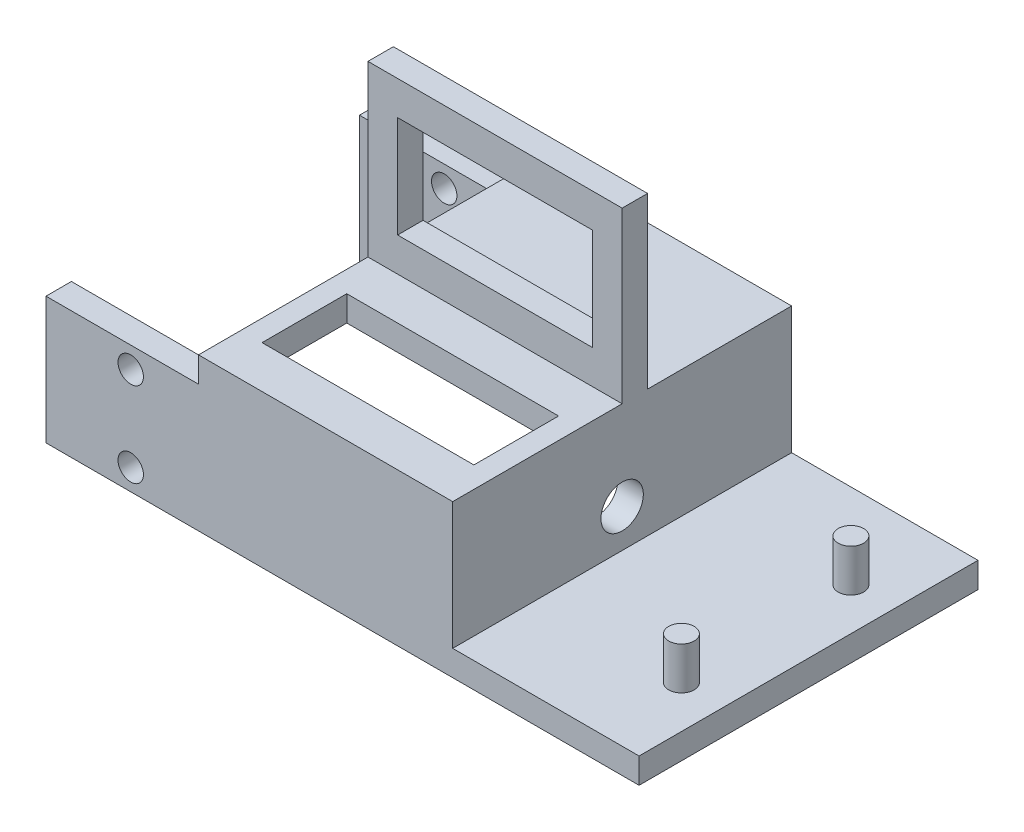
ISO-10303-21;
HEADER;
FILE_DESCRIPTION(('STEP AP214'),'2;1');
FILE_NAME('part.step','',(''),(''),'','','');
FILE_SCHEMA(('AUTOMOTIVE_DESIGN { 1 0 10303 214 1 1 1 1 }'));
ENDSEC;
DATA;
#1=APPLICATION_CONTEXT('core data for automotive mechanical design processes');
#2=APPLICATION_PROTOCOL_DEFINITION('international standard','automotive_design',2000,#1);
#3=PRODUCT_CONTEXT('',#1,'mechanical');
#4=PRODUCT('Part','Part','',(#3));
#5=PRODUCT_RELATED_PRODUCT_CATEGORY('part','',(#4));
#6=PRODUCT_DEFINITION_FORMATION('','',#4);
#7=PRODUCT_DEFINITION_CONTEXT('part definition',#1,'design');
#8=PRODUCT_DEFINITION('design','',#6,#7);
#9=PRODUCT_DEFINITION_SHAPE('','',#8);
#10=(LENGTH_UNIT() NAMED_UNIT(*) SI_UNIT(.MILLI.,.METRE.));
#11=(NAMED_UNIT(*) PLANE_ANGLE_UNIT() SI_UNIT($,.RADIAN.));
#12=(NAMED_UNIT(*) SI_UNIT($,.STERADIAN.) SOLID_ANGLE_UNIT());
#13=UNCERTAINTY_MEASURE_WITH_UNIT(LENGTH_MEASURE(1.E-05),#10,'distance_accuracy_value','');
#14=(GEOMETRIC_REPRESENTATION_CONTEXT(3) GLOBAL_UNCERTAINTY_ASSIGNED_CONTEXT((#13)) GLOBAL_UNIT_ASSIGNED_CONTEXT((#10,
#11,#12)) REPRESENTATION_CONTEXT('',''));
#15=CARTESIAN_POINT('',(0.,0.,0.));
#16=DIRECTION('',(0.,0.,1.));
#17=DIRECTION('',(1.,0.,0.));
#18=AXIS2_PLACEMENT_3D('',#15,#16,#17);
#19=CARTESIAN_POINT('',(0.,18.,0.));
#20=DIRECTION('',(0.,1.,0.));
#21=DIRECTION('',(0.,0.,1.));
#22=AXIS2_PLACEMENT_3D('',#19,#20,#21);
#23=PLANE('',#22);
#24=DIRECTION('',(0.,0.,1.));
#25=VECTOR('',#24,1.);
#26=CARTESIAN_POINT('',(-27.,18.,40.));
#27=LINE('',#26,#25);
#28=CARTESIAN_POINT('',(-27.,18.,0.));
#29=VERTEX_POINT('',#28);
#30=CARTESIAN_POINT('',(-27.,18.,17.));
#31=VERTEX_POINT('',#30);
#32=EDGE_CURVE('E66',#29,#31,#27,.T.);
#33=ORIENTED_EDGE('',*,*,#32,.T.);
#34=DIRECTION('',(1.,0.,0.));
#35=VECTOR('',#34,1.);
#36=CARTESIAN_POINT('',(-27.,18.,17.));
#37=LINE('',#36,#35);
#38=CARTESIAN_POINT('',(3.,18.,17.));
#39=VERTEX_POINT('',#38);
#40=EDGE_CURVE('E241',#31,#39,#37,.T.);
#41=ORIENTED_EDGE('',*,*,#40,.T.);
#42=DIRECTION('',(0.,0.,-1.));
#43=VECTOR('',#42,1.);
#44=CARTESIAN_POINT('',(3.,18.,40.));
#45=LINE('',#44,#43);
#46=CARTESIAN_POINT('',(3.,18.,0.));
#47=VERTEX_POINT('',#46);
#48=EDGE_CURVE('E353',#39,#47,#45,.T.);
#49=ORIENTED_EDGE('',*,*,#48,.T.);
#50=DIRECTION('',(-1.,0.,0.));
#51=VECTOR('',#50,1.);
#52=CARTESIAN_POINT('',(3.,18.,0.));
#53=LINE('',#52,#51);
#54=EDGE_CURVE('E350',#47,#29,#53,.T.);
#55=ORIENTED_EDGE('',*,*,#54,.T.);
#56=EDGE_LOOP('',(#33,#41,#49,#55));
#57=FACE_BOUND('',#56,.T.);
#58=ADVANCED_FACE('F38',(#57),#23,.T.);
#59=CARTESIAN_POINT('',(3.,15.,40.));
#60=DIRECTION('',(0.,-1.,0.));
#61=DIRECTION('',(0.,0.,-1.));
#62=AXIS2_PLACEMENT_3D('',#59,#60,#61);
#63=PLANE('',#62);
#64=DIRECTION('',(0.,0.,1.));
#65=VECTOR('',#64,1.);
#66=CARTESIAN_POINT('',(-27.,15.,40.));
#67=LINE('',#66,#65);
#68=CARTESIAN_POINT('',(-27.,15.,0.));
#69=VERTEX_POINT('',#68);
#70=CARTESIAN_POINT('',(-27.,15.,3.));
#71=VERTEX_POINT('',#70);
#72=EDGE_CURVE('E50',#69,#71,#67,.T.);
#73=ORIENTED_EDGE('',*,*,#72,.F.);
#74=DIRECTION('',(-1.,0.,0.));
#75=VECTOR('',#74,1.);
#76=CARTESIAN_POINT('',(3.,15.,0.));
#77=LINE('',#76,#75);
#78=CARTESIAN_POINT('',(-45.,15.,0.));
#79=VERTEX_POINT('',#78);
#80=EDGE_CURVE('E398',#69,#79,#77,.T.);
#81=ORIENTED_EDGE('',*,*,#80,.T.);
#82=DIRECTION('',(0.,0.,-1.));
#83=VECTOR('',#82,1.);
#84=CARTESIAN_POINT('',(-45.,15.,3.));
#85=LINE('',#84,#83);
#86=CARTESIAN_POINT('',(-45.,15.,3.));
#87=VERTEX_POINT('',#86);
#88=EDGE_CURVE('E371',#87,#79,#85,.T.);
#89=ORIENTED_EDGE('',*,*,#88,.F.);
#90=DIRECTION('',(1.,0.,0.));
#91=VECTOR('',#90,1.);
#92=CARTESIAN_POINT('',(0.,15.,3.));
#93=LINE('',#92,#91);
#94=EDGE_CURVE('E428',#87,#71,#93,.T.);
#95=ORIENTED_EDGE('',*,*,#94,.T.);
#96=EDGE_LOOP('',(#73,#81,#89,#95));
#97=FACE_BOUND('',#96,.T.);
#98=ADVANCED_FACE('F525',(#97),#63,.F.);
#99=CARTESIAN_POINT('',(-27.,15.,37.));
#100=VERTEX_POINT('',#99);
#101=CARTESIAN_POINT('',(-27.,15.,40.));
#102=VERTEX_POINT('',#101);
#103=EDGE_CURVE('E12',#100,#102,#67,.T.);
#104=ORIENTED_EDGE('',*,*,#103,.F.);
#105=DIRECTION('',(-1.,0.,0.));
#106=VECTOR('',#105,1.);
#107=CARTESIAN_POINT('',(0.,15.,37.));
#108=LINE('',#107,#106);
#109=CARTESIAN_POINT('',(-45.,15.,37.));
#110=VERTEX_POINT('',#109);
#111=EDGE_CURVE('E465',#100,#110,#108,.T.);
#112=ORIENTED_EDGE('',*,*,#111,.T.);
#113=DIRECTION('',(0.,0.,1.));
#114=VECTOR('',#113,1.);
#115=CARTESIAN_POINT('',(-45.,15.,37.));
#116=LINE('',#115,#114);
#117=CARTESIAN_POINT('',(-45.,15.,40.));
#118=VERTEX_POINT('',#117);
#119=EDGE_CURVE('E447',#110,#118,#116,.T.);
#120=ORIENTED_EDGE('',*,*,#119,.T.);
#121=DIRECTION('',(-1.,0.,0.));
#122=VECTOR('',#121,1.);
#123=CARTESIAN_POINT('',(3.,15.,40.));
#124=LINE('',#123,#122);
#125=EDGE_CURVE('E410',#102,#118,#124,.T.);
#126=ORIENTED_EDGE('',*,*,#125,.F.);
#127=EDGE_LOOP('',(#104,#112,#120,#126));
#128=FACE_BOUND('',#127,.T.);
#129=ADVANCED_FACE('F585',(#128),#63,.F.);
#130=CARTESIAN_POINT('',(25.,0.,40.));
#131=DIRECTION('',(-1.,0.,0.));
#132=DIRECTION('',(0.,0.,1.));
#133=AXIS2_PLACEMENT_3D('',#130,#131,#132);
#134=PLANE('',#133);
#135=DIRECTION('',(0.,1.,0.));
#136=VECTOR('',#135,1.);
#137=CARTESIAN_POINT('',(25.,0.,0.));
#138=LINE('',#137,#136);
#139=CARTESIAN_POINT('',(25.,0.,0.));
#140=VERTEX_POINT('',#139);
#141=CARTESIAN_POINT('',(25.,3.,0.));
#142=VERTEX_POINT('',#141);
#143=EDGE_CURVE('E405',#140,#142,#138,.T.);
#144=ORIENTED_EDGE('',*,*,#143,.T.);
#145=DIRECTION('',(0.,0.,-1.));
#146=VECTOR('',#145,1.);
#147=CARTESIAN_POINT('',(25.,3.,40.));
#148=LINE('',#147,#146);
#149=CARTESIAN_POINT('',(25.,3.,40.));
#150=VERTEX_POINT('',#149);
#151=EDGE_CURVE('E378',#150,#142,#148,.T.);
#152=ORIENTED_EDGE('',*,*,#151,.F.);
#153=DIRECTION('',(0.,1.,0.));
#154=VECTOR('',#153,1.);
#155=CARTESIAN_POINT('',(25.,0.,40.));
#156=LINE('',#155,#154);
#157=CARTESIAN_POINT('',(25.,0.,40.));
#158=VERTEX_POINT('',#157);
#159=EDGE_CURVE('E397',#158,#150,#156,.T.);
#160=ORIENTED_EDGE('',*,*,#159,.F.);
#161=DIRECTION('',(0.,0.,-1.));
#162=VECTOR('',#161,1.);
#163=CARTESIAN_POINT('',(25.,0.,40.));
#164=LINE('',#163,#162);
#165=EDGE_CURVE('E391',#158,#140,#164,.T.);
#166=ORIENTED_EDGE('',*,*,#165,.T.);
#167=EDGE_LOOP('',(#144,#152,#160,#166));
#168=FACE_BOUND('',#167,.T.);
#169=ADVANCED_FACE('F40',(#168),#134,.F.);
#170=CARTESIAN_POINT('',(25.,3.,40.));
#171=DIRECTION('',(0.,-1.,0.));
#172=DIRECTION('',(1.,0.,0.));
#173=AXIS2_PLACEMENT_3D('',#170,#171,#172);
#174=PLANE('',#173);
#175=CARTESIAN_POINT('',(20.,3.,30.));
#176=DIRECTION('',(0.,-1.,0.));
#177=DIRECTION('',(1.,0.,0.));
#178=AXIS2_PLACEMENT_3D('',#175,#176,#177);
#179=CIRCLE('',#178,1.5);
#180=CARTESIAN_POINT('',(21.5,3.,30.));
#181=VERTEX_POINT('',#180);
#182=EDGE_CURVE('E372',#181,#181,#179,.F.);
#183=ORIENTED_EDGE('',*,*,#182,.F.);
#184=EDGE_LOOP('',(#183));
#185=FACE_BOUND('',#184,.T.);
#186=CARTESIAN_POINT('',(20.,3.,10.));
#187=DIRECTION('',(0.,-1.,0.));
#188=DIRECTION('',(1.,0.,0.));
#189=AXIS2_PLACEMENT_3D('',#186,#187,#188);
#190=CIRCLE('',#189,1.5);
#191=CARTESIAN_POINT('',(21.5,3.,10.));
#192=VERTEX_POINT('',#191);
#193=EDGE_CURVE('E375',#192,#192,#190,.F.);
#194=ORIENTED_EDGE('',*,*,#193,.F.);
#195=EDGE_LOOP('',(#194));
#196=FACE_BOUND('',#195,.T.);
#197=DIRECTION('',(-1.,0.,0.));
#198=VECTOR('',#197,1.);
#199=CARTESIAN_POINT('',(25.,3.,0.));
#200=LINE('',#199,#198);
#201=CARTESIAN_POINT('',(3.,3.,0.));
#202=VERTEX_POINT('',#201);
#203=EDGE_CURVE('E403',#142,#202,#200,.T.);
#204=ORIENTED_EDGE('',*,*,#203,.T.);
#205=DIRECTION('',(0.,0.,-1.));
#206=VECTOR('',#205,1.);
#207=CARTESIAN_POINT('',(3.,3.,40.));
#208=LINE('',#207,#206);
#209=CARTESIAN_POINT('',(3.,3.,40.));
#210=VERTEX_POINT('',#209);
#211=EDGE_CURVE('E381',#210,#202,#208,.T.);
#212=ORIENTED_EDGE('',*,*,#211,.F.);
#213=DIRECTION('',(-1.,0.,0.));
#214=VECTOR('',#213,1.);
#215=CARTESIAN_POINT('',(25.,3.,40.));
#216=LINE('',#215,#214);
#217=EDGE_CURVE('E414',#150,#210,#216,.T.);
#218=ORIENTED_EDGE('',*,*,#217,.F.);
#219=ORIENTED_EDGE('',*,*,#151,.T.);
#220=EDGE_LOOP('',(#204,#212,#218,#219));
#221=FACE_BOUND('',#220,.T.);
#222=ADVANCED_FACE('F513',(#185,#196,#221),#174,.F.);
#223=CARTESIAN_POINT('',(3.,3.,40.));
#224=DIRECTION('',(-1.,0.,0.));
#225=DIRECTION('',(0.,-1.,0.));
#226=AXIS2_PLACEMENT_3D('',#223,#224,#225);
#227=PLANE('',#226);
#228=CARTESIAN_POINT('',(3.,7.5,20.));
#229=DIRECTION('',(-1.,0.,0.));
#230=DIRECTION('',(0.,-1.,0.));
#231=AXIS2_PLACEMENT_3D('',#228,#229,#230);
#232=CIRCLE('',#231,2.5);
#233=CARTESIAN_POINT('',(3.,5.,20.));
#234=VERTEX_POINT('',#233);
#235=EDGE_CURVE('E370',#234,#234,#232,.T.);
#236=ORIENTED_EDGE('',*,*,#235,.T.);
#237=EDGE_LOOP('',(#236));
#238=FACE_BOUND('',#237,.T.);
#239=DIRECTION('',(0.,1.,0.));
#240=VECTOR('',#239,1.);
#241=CARTESIAN_POINT('',(3.,3.,0.));
#242=LINE('',#241,#240);
#243=EDGE_CURVE('E400',#202,#47,#242,.T.);
#244=ORIENTED_EDGE('',*,*,#243,.T.);
#245=ORIENTED_EDGE('',*,*,#48,.F.);
#246=DIRECTION('',(0.,1.,0.));
#247=VECTOR('',#246,1.);
#248=CARTESIAN_POINT('',(3.,18.,17.));
#249=LINE('',#248,#247);
#250=CARTESIAN_POINT('',(3.,38.,17.));
#251=VERTEX_POINT('',#250);
#252=EDGE_CURVE('E280',#39,#251,#249,.T.);
#253=ORIENTED_EDGE('',*,*,#252,.T.);
#254=DIRECTION('',(0.,0.,-1.));
#255=VECTOR('',#254,1.);
#256=CARTESIAN_POINT('',(3.,38.,20.));
#257=LINE('',#256,#255);
#258=CARTESIAN_POINT('',(3.,38.,20.));
#259=VERTEX_POINT('',#258);
#260=EDGE_CURVE('E302',#259,#251,#257,.T.);
#261=ORIENTED_EDGE('',*,*,#260,.F.);
#262=DIRECTION('',(0.,1.,0.));
#263=VECTOR('',#262,1.);
#264=CARTESIAN_POINT('',(3.,18.,20.));
#265=LINE('',#264,#263);
#266=CARTESIAN_POINT('',(3.,18.,20.));
#267=VERTEX_POINT('',#266);
#268=EDGE_CURVE('E307',#267,#259,#265,.T.);
#269=ORIENTED_EDGE('',*,*,#268,.F.);
#270=CARTESIAN_POINT('',(3.,18.,40.));
#271=VERTEX_POINT('',#270);
#272=EDGE_CURVE('E355',#271,#267,#45,.T.);
#273=ORIENTED_EDGE('',*,*,#272,.F.);
#274=DIRECTION('',(0.,1.,0.));
#275=VECTOR('',#274,1.);
#276=CARTESIAN_POINT('',(3.,3.,40.));
#277=LINE('',#276,#275);
#278=EDGE_CURVE('E412',#210,#271,#277,.T.);
#279=ORIENTED_EDGE('',*,*,#278,.F.);
#280=ORIENTED_EDGE('',*,*,#211,.T.);
#281=EDGE_LOOP('',(#244,#245,#253,#261,#269,#273,#279,#280));
#282=FACE_BOUND('',#281,.T.);
#283=ADVANCED_FACE('F507',(#238,#282),#227,.F.);
#284=DIRECTION('',(0.,0.,-1.));
#285=VECTOR('',#284,1.);
#286=CARTESIAN_POINT('',(0.500000000000004,15.,25.));
#287=LINE('',#286,#285);
#288=CARTESIAN_POINT('',(0.500000000000005,15.,35.));
#289=VERTEX_POINT('',#288);
#290=CARTESIAN_POINT('',(0.500000000000004,15.,25.));
#291=VERTEX_POINT('',#290);
#292=EDGE_CURVE('E275',#289,#291,#287,.T.);
#293=ORIENTED_EDGE('',*,*,#292,.T.);
#294=DIRECTION('',(-1.,0.,0.));
#295=VECTOR('',#294,1.);
#296=CARTESIAN_POINT('',(-24.5,15.,25.));
#297=LINE('',#296,#295);
#298=CARTESIAN_POINT('',(0.,15.,25.));
#299=VERTEX_POINT('',#298);
#300=EDGE_CURVE('E331',#291,#299,#297,.T.);
#301=ORIENTED_EDGE('',*,*,#300,.T.);
#302=DIRECTION('',(0.,0.,-1.));
#303=VECTOR('',#302,1.);
#304=CARTESIAN_POINT('',(0.,15.,40.));
#305=LINE('',#304,#303);
#306=CARTESIAN_POINT('',(0.,15.,35.));
#307=VERTEX_POINT('',#306);
#308=EDGE_CURVE('E387',#307,#299,#305,.T.);
#309=ORIENTED_EDGE('',*,*,#308,.F.);
#310=DIRECTION('',(1.,0.,0.));
#311=VECTOR('',#310,1.);
#312=CARTESIAN_POINT('',(-24.5,15.,35.));
#313=LINE('',#312,#311);
#314=EDGE_CURVE('E48',#307,#289,#313,.T.);
#315=ORIENTED_EDGE('',*,*,#314,.T.);
#316=EDGE_LOOP('',(#293,#301,#309,#315));
#317=FACE_BOUND('',#316,.T.);
#318=ADVANCED_FACE('F544',(#317),#63,.F.);
#319=CARTESIAN_POINT('',(0.,15.,40.));
#320=DIRECTION('',(1.,0.,0.));
#321=DIRECTION('',(0.,1.,0.));
#322=AXIS2_PLACEMENT_3D('',#319,#320,#321);
#323=PLANE('',#322);
#324=CARTESIAN_POINT('',(0.,7.5,20.));
#325=DIRECTION('',(1.,0.,0.));
#326=DIRECTION('',(0.,1.,0.));
#327=AXIS2_PLACEMENT_3D('',#324,#325,#326);
#328=CIRCLE('',#327,2.5);
#329=CARTESIAN_POINT('',(0.,10.,20.));
#330=VERTEX_POINT('',#329);
#331=EDGE_CURVE('E367',#330,#330,#328,.T.);
#332=ORIENTED_EDGE('',*,*,#331,.T.);
#333=EDGE_LOOP('',(#332));
#334=FACE_BOUND('',#333,.T.);
#335=DIRECTION('',(0.,0.,-1.));
#336=VECTOR('',#335,1.);
#337=CARTESIAN_POINT('',(0.,0.,40.));
#338=LINE('',#337,#336);
#339=CARTESIAN_POINT('',(0.,0.,37.));
#340=VERTEX_POINT('',#339);
#341=CARTESIAN_POINT('',(0.,0.,3.));
#342=VERTEX_POINT('',#341);
#343=EDGE_CURVE('E389',#340,#342,#338,.T.);
#344=ORIENTED_EDGE('',*,*,#343,.F.);
#345=DIRECTION('',(0.,1.,0.));
#346=VECTOR('',#345,1.);
#347=CARTESIAN_POINT('',(0.,15.,37.));
#348=LINE('',#347,#346);
#349=CARTESIAN_POINT('',(0.,15.,37.));
#350=VERTEX_POINT('',#349);
#351=EDGE_CURVE('E456',#340,#350,#348,.T.);
#352=ORIENTED_EDGE('',*,*,#351,.T.);
#353=EDGE_CURVE('E384',#350,#307,#305,.T.);
#354=ORIENTED_EDGE('',*,*,#353,.T.);
#355=ORIENTED_EDGE('',*,*,#308,.T.);
#356=CARTESIAN_POINT('',(0.,15.,3.));
#357=VERTEX_POINT('',#356);
#358=EDGE_CURVE('E388',#299,#357,#305,.T.);
#359=ORIENTED_EDGE('',*,*,#358,.T.);
#360=DIRECTION('',(0.,-1.,0.));
#361=VECTOR('',#360,1.);
#362=CARTESIAN_POINT('',(0.,15.,3.));
#363=LINE('',#362,#361);
#364=EDGE_CURVE('E434',#357,#342,#363,.T.);
#365=ORIENTED_EDGE('',*,*,#364,.T.);
#366=EDGE_LOOP('',(#344,#352,#354,#355,#359,#365));
#367=FACE_BOUND('',#366,.T.);
#368=ADVANCED_FACE('F540',(#334,#367),#323,.F.);
#369=CARTESIAN_POINT('',(0.,0.,40.));
#370=DIRECTION('',(0.,1.,0.));
#371=DIRECTION('',(0.,0.,1.));
#372=AXIS2_PLACEMENT_3D('',#369,#370,#371);
#373=PLANE('',#372);
#374=DIRECTION('',(1.,0.,0.));
#375=VECTOR('',#374,1.);
#376=CARTESIAN_POINT('',(0.,0.,0.));
#377=LINE('',#376,#375);
#378=CARTESIAN_POINT('',(-45.,0.,0.));
#379=VERTEX_POINT('',#378);
#380=EDGE_CURVE('E395',#379,#140,#377,.T.);
#381=ORIENTED_EDGE('',*,*,#380,.T.);
#382=ORIENTED_EDGE('',*,*,#165,.F.);
#383=DIRECTION('',(1.,0.,0.));
#384=VECTOR('',#383,1.);
#385=CARTESIAN_POINT('',(0.,0.,40.));
#386=LINE('',#385,#384);
#387=CARTESIAN_POINT('',(-45.,0.,40.));
#388=VERTEX_POINT('',#387);
#389=EDGE_CURVE('E394',#388,#158,#386,.T.);
#390=ORIENTED_EDGE('',*,*,#389,.F.);
#391=DIRECTION('',(0.,0.,1.));
#392=VECTOR('',#391,1.);
#393=CARTESIAN_POINT('',(-45.,0.,37.));
#394=LINE('',#393,#392);
#395=CARTESIAN_POINT('',(-45.,0.,37.));
#396=VERTEX_POINT('',#395);
#397=EDGE_CURVE('E435',#396,#388,#394,.T.);
#398=ORIENTED_EDGE('',*,*,#397,.F.);
#399=DIRECTION('',(1.,0.,0.));
#400=VECTOR('',#399,1.);
#401=CARTESIAN_POINT('',(0.,0.,37.));
#402=LINE('',#401,#400);
#403=EDGE_CURVE('E450',#396,#340,#402,.T.);
#404=ORIENTED_EDGE('',*,*,#403,.T.);
#405=ORIENTED_EDGE('',*,*,#343,.T.);
#406=DIRECTION('',(-1.,0.,0.));
#407=VECTOR('',#406,1.);
#408=CARTESIAN_POINT('',(0.,0.,3.));
#409=LINE('',#408,#407);
#410=CARTESIAN_POINT('',(-45.,0.,3.));
#411=VERTEX_POINT('',#410);
#412=EDGE_CURVE('E442',#342,#411,#409,.T.);
#413=ORIENTED_EDGE('',*,*,#412,.T.);
#414=DIRECTION('',(0.,0.,-1.));
#415=VECTOR('',#414,1.);
#416=CARTESIAN_POINT('',(-45.,0.,3.));
#417=LINE('',#416,#415);
#418=EDGE_CURVE('E425',#411,#379,#417,.T.);
#419=ORIENTED_EDGE('',*,*,#418,.T.);
#420=EDGE_LOOP('',(#381,#382,#390,#398,#404,#405,#413,#419));
#421=FACE_BOUND('',#420,.T.);
#422=ADVANCED_FACE('F518',(#421),#373,.F.);
#423=CARTESIAN_POINT('',(0.,0.,40.));
#424=DIRECTION('',(0.,0.,1.));
#425=DIRECTION('',(1.,0.,0.));
#426=AXIS2_PLACEMENT_3D('',#423,#424,#425);
#427=PLANE('',#426);
#428=CARTESIAN_POINT('',(-35.,12.5,40.));
#429=DIRECTION('',(0.,0.,1.));
#430=DIRECTION('',(1.,0.,0.));
#431=AXIS2_PLACEMENT_3D('',#428,#429,#430);
#432=CIRCLE('',#431,1.5);
#433=CARTESIAN_POINT('',(-33.5,12.5,40.));
#434=VERTEX_POINT('',#433);
#435=EDGE_CURVE('E457',#434,#434,#432,.T.);
#436=ORIENTED_EDGE('',*,*,#435,.F.);
#437=EDGE_LOOP('',(#436));
#438=FACE_BOUND('',#437,.T.);
#439=CARTESIAN_POINT('',(-35.,2.5,40.));
#440=DIRECTION('',(0.,0.,1.));
#441=DIRECTION('',(1.,0.,0.));
#442=AXIS2_PLACEMENT_3D('',#439,#440,#441);
#443=CIRCLE('',#442,1.5);
#444=CARTESIAN_POINT('',(-33.5,2.5,40.));
#445=VERTEX_POINT('',#444);
#446=EDGE_CURVE('E361',#445,#445,#443,.T.);
#447=ORIENTED_EDGE('',*,*,#446,.F.);
#448=EDGE_LOOP('',(#447));
#449=FACE_BOUND('',#448,.T.);
#450=ORIENTED_EDGE('',*,*,#159,.T.);
#451=ORIENTED_EDGE('',*,*,#217,.T.);
#452=ORIENTED_EDGE('',*,*,#278,.T.);
#453=DIRECTION('',(1.,0.,0.));
#454=VECTOR('',#453,1.);
#455=CARTESIAN_POINT('',(3.,18.,40.));
#456=LINE('',#455,#454);
#457=CARTESIAN_POINT('',(-27.,18.,40.));
#458=VERTEX_POINT('',#457);
#459=EDGE_CURVE('E485',#458,#271,#456,.T.);
#460=ORIENTED_EDGE('',*,*,#459,.F.);
#461=DIRECTION('',(0.,-1.,0.));
#462=VECTOR('',#461,1.);
#463=CARTESIAN_POINT('',(-27.,18.,40.));
#464=LINE('',#463,#462);
#465=EDGE_CURVE('E483',#458,#102,#464,.T.);
#466=ORIENTED_EDGE('',*,*,#465,.T.);
#467=ORIENTED_EDGE('',*,*,#125,.T.);
#468=DIRECTION('',(0.,-1.,0.));
#469=VECTOR('',#468,1.);
#470=CARTESIAN_POINT('',(-45.,15.,40.));
#471=LINE('',#470,#469);
#472=EDGE_CURVE('E453',#118,#388,#471,.T.);
#473=ORIENTED_EDGE('',*,*,#472,.T.);
#474=ORIENTED_EDGE('',*,*,#389,.T.);
#475=EDGE_LOOP('',(#450,#451,#452,#460,#466,#467,#473,#474));
#476=FACE_BOUND('',#475,.T.);
#477=ADVANCED_FACE('F643',(#438,#449,#476),#427,.T.);
#478=CARTESIAN_POINT('',(0.,0.,0.));
#479=DIRECTION('',(0.,0.,1.));
#480=DIRECTION('',(1.,0.,0.));
#481=AXIS2_PLACEMENT_3D('',#478,#479,#480);
#482=PLANE('',#481);
#483=CARTESIAN_POINT('',(-35.,12.5,0.));
#484=DIRECTION('',(0.,0.,1.));
#485=DIRECTION('',(1.,0.,0.));
#486=AXIS2_PLACEMENT_3D('',#483,#484,#485);
#487=CIRCLE('',#486,1.5);
#488=CARTESIAN_POINT('',(-33.5,12.5,0.));
#489=VERTEX_POINT('',#488);
#490=EDGE_CURVE('E366',#489,#489,#487,.T.);
#491=ORIENTED_EDGE('',*,*,#490,.T.);
#492=EDGE_LOOP('',(#491));
#493=FACE_BOUND('',#492,.T.);
#494=CARTESIAN_POINT('',(-35.,2.5,0.));
#495=DIRECTION('',(0.,0.,1.));
#496=DIRECTION('',(-1.,0.,0.));
#497=AXIS2_PLACEMENT_3D('',#494,#495,#496);
#498=CIRCLE('',#497,1.5);
#499=CARTESIAN_POINT('',(-36.5,2.5,0.));
#500=VERTEX_POINT('',#499);
#501=EDGE_CURVE('E476',#500,#500,#498,.T.);
#502=ORIENTED_EDGE('',*,*,#501,.T.);
#503=EDGE_LOOP('',(#502));
#504=FACE_BOUND('',#503,.T.);
#505=ORIENTED_EDGE('',*,*,#143,.F.);
#506=ORIENTED_EDGE('',*,*,#380,.F.);
#507=DIRECTION('',(0.,1.,0.));
#508=VECTOR('',#507,1.);
#509=CARTESIAN_POINT('',(-45.,15.,0.));
#510=LINE('',#509,#508);
#511=EDGE_CURVE('E431',#379,#79,#510,.T.);
#512=ORIENTED_EDGE('',*,*,#511,.T.);
#513=ORIENTED_EDGE('',*,*,#80,.F.);
#514=DIRECTION('',(0.,-1.,0.));
#515=VECTOR('',#514,1.);
#516=CARTESIAN_POINT('',(-27.,18.,0.));
#517=LINE('',#516,#515);
#518=EDGE_CURVE('E479',#29,#69,#517,.T.);
#519=ORIENTED_EDGE('',*,*,#518,.F.);
#520=ORIENTED_EDGE('',*,*,#54,.F.);
#521=ORIENTED_EDGE('',*,*,#243,.F.);
#522=ORIENTED_EDGE('',*,*,#203,.F.);
#523=EDGE_LOOP('',(#505,#506,#512,#513,#519,#520,#521,#522));
#524=FACE_BOUND('',#523,.T.);
#525=ADVANCED_FACE('F499',(#493,#504,#524),#482,.F.);
#526=CARTESIAN_POINT('',(20.,8.,10.));
#527=DIRECTION('',(0.,-1.,0.));
#528=DIRECTION('',(1.,0.,0.));
#529=AXIS2_PLACEMENT_3D('',#526,#527,#528);
#530=CYLINDRICAL_SURFACE('',#529,1.5);
#531=CARTESIAN_POINT('',(20.,8.,10.));
#532=DIRECTION('',(0.,1.,0.));
#533=DIRECTION('',(-1.,0.,0.));
#534=AXIS2_PLACEMENT_3D('',#531,#532,#533);
#535=CIRCLE('',#534,1.5);
#536=CARTESIAN_POINT('',(18.5,8.,10.));
#537=VERTEX_POINT('',#536);
#538=EDGE_CURVE('E408',#537,#537,#535,.T.);
#539=ORIENTED_EDGE('',*,*,#538,.F.);
#540=EDGE_LOOP('',(#539));
#541=FACE_BOUND('',#540,.T.);
#542=ORIENTED_EDGE('',*,*,#193,.T.);
#543=EDGE_LOOP('',(#542));
#544=FACE_BOUND('',#543,.T.);
#545=ADVANCED_FACE('F638',(#541,#544),#530,.T.);
#546=CARTESIAN_POINT('',(20.,8.,10.));
#547=DIRECTION('',(0.,1.,0.));
#548=DIRECTION('',(-1.,0.,0.));
#549=AXIS2_PLACEMENT_3D('',#546,#547,#548);
#550=PLANE('',#549);
#551=ORIENTED_EDGE('',*,*,#538,.T.);
#552=EDGE_LOOP('',(#551));
#553=FACE_BOUND('',#552,.T.);
#554=ADVANCED_FACE('F634',(#553),#550,.T.);
#555=CARTESIAN_POINT('',(20.,8.,30.));
#556=DIRECTION('',(0.,-1.,0.));
#557=DIRECTION('',(1.,0.,0.));
#558=AXIS2_PLACEMENT_3D('',#555,#556,#557);
#559=CYLINDRICAL_SURFACE('',#558,1.5);
#560=CARTESIAN_POINT('',(20.,8.,30.));
#561=DIRECTION('',(0.,1.,0.));
#562=DIRECTION('',(1.,0.,0.));
#563=AXIS2_PLACEMENT_3D('',#560,#561,#562);
#564=CIRCLE('',#563,1.5);
#565=CARTESIAN_POINT('',(21.5,8.,30.));
#566=VERTEX_POINT('',#565);
#567=EDGE_CURVE('E420',#566,#566,#564,.T.);
#568=ORIENTED_EDGE('',*,*,#567,.F.);
#569=EDGE_LOOP('',(#568));
#570=FACE_BOUND('',#569,.T.);
#571=ORIENTED_EDGE('',*,*,#182,.T.);
#572=EDGE_LOOP('',(#571));
#573=FACE_BOUND('',#572,.T.);
#574=ADVANCED_FACE('F630',(#570,#573),#559,.T.);
#575=CARTESIAN_POINT('',(20.,8.,30.));
#576=DIRECTION('',(0.,-1.,0.));
#577=DIRECTION('',(1.,0.,0.));
#578=AXIS2_PLACEMENT_3D('',#575,#576,#577);
#579=PLANE('',#578);
#580=ORIENTED_EDGE('',*,*,#567,.T.);
#581=EDGE_LOOP('',(#580));
#582=FACE_BOUND('',#581,.T.);
#583=ADVANCED_FACE('F626',(#582),#579,.F.);
#584=CARTESIAN_POINT('',(25.,7.5,20.));
#585=DIRECTION('',(-1.,0.,0.));
#586=DIRECTION('',(0.,-1.,0.));
#587=AXIS2_PLACEMENT_3D('',#584,#585,#586);
#588=CYLINDRICAL_SURFACE('',#587,2.5);
#589=ORIENTED_EDGE('',*,*,#331,.F.);
#590=EDGE_LOOP('',(#589));
#591=FACE_BOUND('',#590,.T.);
#592=ORIENTED_EDGE('',*,*,#235,.F.);
#593=EDGE_LOOP('',(#592));
#594=FACE_BOUND('',#593,.T.);
#595=ADVANCED_FACE('F623',(#591,#594),#588,.F.);
#596=CARTESIAN_POINT('',(-45.,15.,3.));
#597=DIRECTION('',(-1.,0.,0.));
#598=DIRECTION('',(0.,0.,1.));
#599=AXIS2_PLACEMENT_3D('',#596,#597,#598);
#600=PLANE('',#599);
#601=ORIENTED_EDGE('',*,*,#511,.F.);
#602=ORIENTED_EDGE('',*,*,#418,.F.);
#603=DIRECTION('',(0.,1.,0.));
#604=VECTOR('',#603,1.);
#605=CARTESIAN_POINT('',(-45.,15.,3.));
#606=LINE('',#605,#604);
#607=EDGE_CURVE('E439',#411,#87,#606,.T.);
#608=ORIENTED_EDGE('',*,*,#607,.T.);
#609=ORIENTED_EDGE('',*,*,#88,.T.);
#610=EDGE_LOOP('',(#601,#602,#608,#609));
#611=FACE_BOUND('',#610,.T.);
#612=ADVANCED_FACE('F521',(#611),#600,.T.);
#613=CARTESIAN_POINT('',(0.,0.,3.));
#614=DIRECTION('',(0.,0.,-1.));
#615=DIRECTION('',(-1.,0.,0.));
#616=AXIS2_PLACEMENT_3D('',#613,#614,#615);
#617=PLANE('',#616);
#618=CARTESIAN_POINT('',(-35.,12.5,3.));
#619=DIRECTION('',(0.,0.,-1.));
#620=DIRECTION('',(-1.,0.,0.));
#621=AXIS2_PLACEMENT_3D('',#618,#619,#620);
#622=CIRCLE('',#621,1.5);
#623=CARTESIAN_POINT('',(-36.5,12.5,3.));
#624=VERTEX_POINT('',#623);
#625=EDGE_CURVE('E360',#624,#624,#622,.T.);
#626=ORIENTED_EDGE('',*,*,#625,.T.);
#627=EDGE_LOOP('',(#626));
#628=FACE_BOUND('',#627,.T.);
#629=CARTESIAN_POINT('',(-35.,2.5,3.));
#630=DIRECTION('',(0.,0.,-1.));
#631=DIRECTION('',(-1.,0.,0.));
#632=AXIS2_PLACEMENT_3D('',#629,#630,#631);
#633=CIRCLE('',#632,1.5);
#634=CARTESIAN_POINT('',(-36.5,2.5,3.));
#635=VERTEX_POINT('',#634);
#636=EDGE_CURVE('E365',#635,#635,#633,.T.);
#637=ORIENTED_EDGE('',*,*,#636,.T.);
#638=EDGE_LOOP('',(#637));
#639=FACE_BOUND('',#638,.T.);
#640=ORIENTED_EDGE('',*,*,#364,.F.);
#641=EDGE_CURVE('E438',#71,#357,#93,.T.);
#642=ORIENTED_EDGE('',*,*,#641,.F.);
#643=ORIENTED_EDGE('',*,*,#94,.F.);
#644=ORIENTED_EDGE('',*,*,#607,.F.);
#645=ORIENTED_EDGE('',*,*,#412,.F.);
#646=EDGE_LOOP('',(#640,#642,#643,#644,#645));
#647=FACE_BOUND('',#646,.T.);
#648=ADVANCED_FACE('F531',(#628,#639,#647),#617,.F.);
#649=CARTESIAN_POINT('',(-45.,15.,37.));
#650=DIRECTION('',(-1.,0.,0.));
#651=DIRECTION('',(0.,0.,1.));
#652=AXIS2_PLACEMENT_3D('',#649,#650,#651);
#653=PLANE('',#652);
#654=ORIENTED_EDGE('',*,*,#472,.F.);
#655=ORIENTED_EDGE('',*,*,#119,.F.);
#656=DIRECTION('',(0.,-1.,0.));
#657=VECTOR('',#656,1.);
#658=CARTESIAN_POINT('',(-45.,15.,37.));
#659=LINE('',#658,#657);
#660=EDGE_CURVE('E460',#110,#396,#659,.T.);
#661=ORIENTED_EDGE('',*,*,#660,.T.);
#662=ORIENTED_EDGE('',*,*,#397,.T.);
#663=EDGE_LOOP('',(#654,#655,#661,#662));
#664=FACE_BOUND('',#663,.T.);
#665=ADVANCED_FACE('F613',(#664),#653,.T.);
#666=CARTESIAN_POINT('',(0.,0.,37.));
#667=DIRECTION('',(0.,0.,-1.));
#668=DIRECTION('',(-1.,0.,0.));
#669=AXIS2_PLACEMENT_3D('',#666,#667,#668);
#670=PLANE('',#669);
#671=CARTESIAN_POINT('',(-35.,12.5,37.));
#672=DIRECTION('',(0.,0.,-1.));
#673=DIRECTION('',(-1.,0.,0.));
#674=AXIS2_PLACEMENT_3D('',#671,#672,#673);
#675=CIRCLE('',#674,1.5);
#676=CARTESIAN_POINT('',(-36.5,12.5,37.));
#677=VERTEX_POINT('',#676);
#678=EDGE_CURVE('E357',#677,#677,#675,.T.);
#679=ORIENTED_EDGE('',*,*,#678,.F.);
#680=EDGE_LOOP('',(#679));
#681=FACE_BOUND('',#680,.T.);
#682=CARTESIAN_POINT('',(-35.,2.5,37.));
#683=DIRECTION('',(0.,0.,-1.));
#684=DIRECTION('',(-1.,0.,0.));
#685=AXIS2_PLACEMENT_3D('',#682,#683,#684);
#686=CIRCLE('',#685,1.5);
#687=CARTESIAN_POINT('',(-36.5,2.5,37.));
#688=VERTEX_POINT('',#687);
#689=EDGE_CURVE('E362',#688,#688,#686,.T.);
#690=ORIENTED_EDGE('',*,*,#689,.F.);
#691=EDGE_LOOP('',(#690));
#692=FACE_BOUND('',#691,.T.);
#693=ORIENTED_EDGE('',*,*,#351,.F.);
#694=ORIENTED_EDGE('',*,*,#403,.F.);
#695=ORIENTED_EDGE('',*,*,#660,.F.);
#696=ORIENTED_EDGE('',*,*,#111,.F.);
#697=EDGE_CURVE('E463',#350,#100,#108,.T.);
#698=ORIENTED_EDGE('',*,*,#697,.F.);
#699=EDGE_LOOP('',(#693,#694,#695,#696,#698));
#700=FACE_BOUND('',#699,.T.);
#701=ADVANCED_FACE('F609',(#681,#692,#700),#670,.T.);
#702=CARTESIAN_POINT('',(-35.,2.5,0.));
#703=DIRECTION('',(0.,0.,1.));
#704=DIRECTION('',(1.,0.,0.));
#705=AXIS2_PLACEMENT_3D('',#702,#703,#704);
#706=CYLINDRICAL_SURFACE('',#705,1.5);
#707=ORIENTED_EDGE('',*,*,#446,.T.);
#708=EDGE_LOOP('',(#707));
#709=FACE_BOUND('',#708,.T.);
#710=ORIENTED_EDGE('',*,*,#689,.T.);
#711=EDGE_LOOP('',(#710));
#712=FACE_BOUND('',#711,.T.);
#713=ADVANCED_FACE('F605',(#709,#712),#706,.F.);
#714=CARTESIAN_POINT('',(-35.,12.5,0.));
#715=DIRECTION('',(0.,0.,1.));
#716=DIRECTION('',(1.,0.,0.));
#717=AXIS2_PLACEMENT_3D('',#714,#715,#716);
#718=CYLINDRICAL_SURFACE('',#717,1.5);
#719=ORIENTED_EDGE('',*,*,#435,.T.);
#720=EDGE_LOOP('',(#719));
#721=FACE_BOUND('',#720,.T.);
#722=ORIENTED_EDGE('',*,*,#678,.T.);
#723=EDGE_LOOP('',(#722));
#724=FACE_BOUND('',#723,.T.);
#725=ADVANCED_FACE('F602',(#721,#724),#718,.F.);
#726=ORIENTED_EDGE('',*,*,#501,.F.);
#727=EDGE_LOOP('',(#726));
#728=FACE_BOUND('',#727,.T.);
#729=ORIENTED_EDGE('',*,*,#636,.F.);
#730=EDGE_LOOP('',(#729));
#731=FACE_BOUND('',#730,.T.);
#732=ADVANCED_FACE('F599',(#728,#731),#706,.F.);
#733=ORIENTED_EDGE('',*,*,#490,.F.);
#734=EDGE_LOOP('',(#733));
#735=FACE_BOUND('',#734,.T.);
#736=ORIENTED_EDGE('',*,*,#625,.F.);
#737=EDGE_LOOP('',(#736));
#738=FACE_BOUND('',#737,.T.);
#739=ADVANCED_FACE('F595',(#735,#738),#718,.F.);
#740=CARTESIAN_POINT('',(0.,15.,0.));
#741=DIRECTION('',(0.,1.,0.));
#742=DIRECTION('',(0.,0.,1.));
#743=AXIS2_PLACEMENT_3D('',#740,#741,#742);
#744=PLANE('',#743);
#745=EDGE_CURVE('E51',#71,#100,#67,.T.);
#746=ORIENTED_EDGE('',*,*,#745,.F.);
#747=ORIENTED_EDGE('',*,*,#641,.T.);
#748=ORIENTED_EDGE('',*,*,#358,.F.);
#749=CARTESIAN_POINT('',(-24.5,15.,25.));
#750=VERTEX_POINT('',#749);
#751=EDGE_CURVE('E330',#299,#750,#297,.T.);
#752=ORIENTED_EDGE('',*,*,#751,.T.);
#753=DIRECTION('',(0.,0.,1.));
#754=VECTOR('',#753,1.);
#755=CARTESIAN_POINT('',(-24.5,15.,25.));
#756=LINE('',#755,#754);
#757=CARTESIAN_POINT('',(-24.5,15.,35.));
#758=VERTEX_POINT('',#757);
#759=EDGE_CURVE('E334',#750,#758,#756,.T.);
#760=ORIENTED_EDGE('',*,*,#759,.T.);
#761=EDGE_CURVE('E320',#758,#307,#313,.T.);
#762=ORIENTED_EDGE('',*,*,#761,.T.);
#763=ORIENTED_EDGE('',*,*,#353,.F.);
#764=ORIENTED_EDGE('',*,*,#697,.T.);
#765=EDGE_LOOP('',(#746,#747,#748,#752,#760,#762,#763,#764));
#766=FACE_BOUND('',#765,.T.);
#767=ADVANCED_FACE('F535',(#766),#744,.F.);
#768=DIRECTION('',(1.,0.,0.));
#769=VECTOR('',#768,1.);
#770=CARTESIAN_POINT('',(-27.,18.,20.));
#771=LINE('',#770,#769);
#772=CARTESIAN_POINT('',(-27.,18.,20.));
#773=VERTEX_POINT('',#772);
#774=EDGE_CURVE('E58',#773,#267,#771,.T.);
#775=ORIENTED_EDGE('',*,*,#774,.F.);
#776=EDGE_CURVE('E42',#773,#458,#27,.T.);
#777=ORIENTED_EDGE('',*,*,#776,.T.);
#778=ORIENTED_EDGE('',*,*,#459,.T.);
#779=ORIENTED_EDGE('',*,*,#272,.T.);
#780=EDGE_LOOP('',(#775,#777,#778,#779));
#781=FACE_BOUND('',#780,.T.);
#782=DIRECTION('',(-1.,0.,0.));
#783=VECTOR('',#782,1.);
#784=CARTESIAN_POINT('',(-24.5,18.,25.));
#785=LINE('',#784,#783);
#786=CARTESIAN_POINT('',(0.500000000000004,18.,25.));
#787=VERTEX_POINT('',#786);
#788=CARTESIAN_POINT('',(-24.5,18.,25.));
#789=VERTEX_POINT('',#788);
#790=EDGE_CURVE('E319',#787,#789,#785,.T.);
#791=ORIENTED_EDGE('',*,*,#790,.F.);
#792=DIRECTION('',(0.,0.,-1.));
#793=VECTOR('',#792,1.);
#794=CARTESIAN_POINT('',(0.500000000000004,18.,25.));
#795=LINE('',#794,#793);
#796=CARTESIAN_POINT('',(0.500000000000005,18.,35.));
#797=VERTEX_POINT('',#796);
#798=EDGE_CURVE('E317',#797,#787,#795,.T.);
#799=ORIENTED_EDGE('',*,*,#798,.F.);
#800=DIRECTION('',(1.,0.,0.));
#801=VECTOR('',#800,1.);
#802=CARTESIAN_POINT('',(-24.5,18.,35.));
#803=LINE('',#802,#801);
#804=CARTESIAN_POINT('',(-24.5,18.,35.));
#805=VERTEX_POINT('',#804);
#806=EDGE_CURVE('E325',#805,#797,#803,.T.);
#807=ORIENTED_EDGE('',*,*,#806,.F.);
#808=DIRECTION('',(0.,0.,1.));
#809=VECTOR('',#808,1.);
#810=CARTESIAN_POINT('',(-24.5,18.,25.));
#811=LINE('',#810,#809);
#812=EDGE_CURVE('E322',#789,#805,#811,.T.);
#813=ORIENTED_EDGE('',*,*,#812,.F.);
#814=EDGE_LOOP('',(#791,#799,#807,#813));
#815=FACE_BOUND('',#814,.T.);
#816=ADVANCED_FACE('F556',(#781,#815),#23,.T.);
#817=CARTESIAN_POINT('',(-27.,18.,40.));
#818=DIRECTION('',(1.,0.,0.));
#819=DIRECTION('',(0.,0.,-1.));
#820=AXIS2_PLACEMENT_3D('',#817,#818,#819);
#821=PLANE('',#820);
#822=ORIENTED_EDGE('',*,*,#72,.T.);
#823=ORIENTED_EDGE('',*,*,#745,.T.);
#824=ORIENTED_EDGE('',*,*,#103,.T.);
#825=ORIENTED_EDGE('',*,*,#465,.F.);
#826=ORIENTED_EDGE('',*,*,#776,.F.);
#827=DIRECTION('',(0.,1.,0.));
#828=VECTOR('',#827,1.);
#829=CARTESIAN_POINT('',(-27.,18.,20.));
#830=LINE('',#829,#828);
#831=CARTESIAN_POINT('',(-27.,38.,20.));
#832=VERTEX_POINT('',#831);
#833=EDGE_CURVE('E273',#773,#832,#830,.T.);
#834=ORIENTED_EDGE('',*,*,#833,.T.);
#835=DIRECTION('',(0.,0.,-1.));
#836=VECTOR('',#835,1.);
#837=CARTESIAN_POINT('',(-27.,38.,20.));
#838=LINE('',#837,#836);
#839=CARTESIAN_POINT('',(-27.,38.,17.));
#840=VERTEX_POINT('',#839);
#841=EDGE_CURVE('E285',#832,#840,#838,.T.);
#842=ORIENTED_EDGE('',*,*,#841,.T.);
#843=DIRECTION('',(0.,1.,0.));
#844=VECTOR('',#843,1.);
#845=CARTESIAN_POINT('',(-27.,18.,17.));
#846=LINE('',#845,#844);
#847=EDGE_CURVE('E276',#31,#840,#846,.T.);
#848=ORIENTED_EDGE('',*,*,#847,.F.);
#849=ORIENTED_EDGE('',*,*,#32,.F.);
#850=ORIENTED_EDGE('',*,*,#518,.T.);
#851=EDGE_LOOP('',(#822,#823,#824,#825,#826,#834,#842,#848,#849,#850));
#852=FACE_BOUND('',#851,.T.);
#853=ADVANCED_FACE('F502',(#852),#821,.F.);
#854=CARTESIAN_POINT('',(0.500000000000004,18.,25.));
#855=DIRECTION('',(-1.,0.,0.));
#856=DIRECTION('',(0.,0.,1.));
#857=AXIS2_PLACEMENT_3D('',#854,#855,#856);
#858=PLANE('',#857);
#859=ORIENTED_EDGE('',*,*,#292,.F.);
#860=DIRECTION('',(0.,-1.,0.));
#861=VECTOR('',#860,1.);
#862=CARTESIAN_POINT('',(0.500000000000005,18.,35.));
#863=LINE('',#862,#861);
#864=EDGE_CURVE('E327',#797,#289,#863,.T.);
#865=ORIENTED_EDGE('',*,*,#864,.F.);
#866=ORIENTED_EDGE('',*,*,#798,.T.);
#867=DIRECTION('',(0.,-1.,0.));
#868=VECTOR('',#867,1.);
#869=CARTESIAN_POINT('',(0.500000000000004,18.,25.));
#870=LINE('',#869,#868);
#871=EDGE_CURVE('E345',#787,#291,#870,.T.);
#872=ORIENTED_EDGE('',*,*,#871,.T.);
#873=EDGE_LOOP('',(#859,#865,#866,#872));
#874=FACE_BOUND('',#873,.T.);
#875=ADVANCED_FACE('F551',(#874),#858,.T.);
#876=CARTESIAN_POINT('',(-24.5,18.,25.));
#877=DIRECTION('',(0.,0.,1.));
#878=DIRECTION('',(1.,0.,0.));
#879=AXIS2_PLACEMENT_3D('',#876,#877,#878);
#880=PLANE('',#879);
#881=ORIENTED_EDGE('',*,*,#300,.F.);
#882=ORIENTED_EDGE('',*,*,#871,.F.);
#883=ORIENTED_EDGE('',*,*,#790,.T.);
#884=DIRECTION('',(0.,-1.,0.));
#885=VECTOR('',#884,1.);
#886=CARTESIAN_POINT('',(-24.5,18.,25.));
#887=LINE('',#886,#885);
#888=EDGE_CURVE('E342',#789,#750,#887,.T.);
#889=ORIENTED_EDGE('',*,*,#888,.T.);
#890=ORIENTED_EDGE('',*,*,#751,.F.);
#891=EDGE_LOOP('',(#881,#882,#883,#889,#890));
#892=FACE_BOUND('',#891,.T.);
#893=ADVANCED_FACE('F548',(#892),#880,.T.);
#894=CARTESIAN_POINT('',(-24.5,18.,25.));
#895=DIRECTION('',(1.,0.,0.));
#896=DIRECTION('',(0.,0.,-1.));
#897=AXIS2_PLACEMENT_3D('',#894,#895,#896);
#898=PLANE('',#897);
#899=ORIENTED_EDGE('',*,*,#759,.F.);
#900=ORIENTED_EDGE('',*,*,#888,.F.);
#901=ORIENTED_EDGE('',*,*,#812,.T.);
#902=DIRECTION('',(0.,-1.,0.));
#903=VECTOR('',#902,1.);
#904=CARTESIAN_POINT('',(-24.5,18.,35.));
#905=LINE('',#904,#903);
#906=EDGE_CURVE('E340',#805,#758,#905,.T.);
#907=ORIENTED_EDGE('',*,*,#906,.T.);
#908=EDGE_LOOP('',(#899,#900,#901,#907));
#909=FACE_BOUND('',#908,.T.);
#910=ADVANCED_FACE('F561',(#909),#898,.T.);
#911=CARTESIAN_POINT('',(-24.5,18.,35.));
#912=DIRECTION('',(0.,0.,-1.));
#913=DIRECTION('',(-1.,0.,0.));
#914=AXIS2_PLACEMENT_3D('',#911,#912,#913);
#915=PLANE('',#914);
#916=ORIENTED_EDGE('',*,*,#761,.F.);
#917=ORIENTED_EDGE('',*,*,#906,.F.);
#918=ORIENTED_EDGE('',*,*,#806,.T.);
#919=ORIENTED_EDGE('',*,*,#864,.T.);
#920=ORIENTED_EDGE('',*,*,#314,.F.);
#921=EDGE_LOOP('',(#916,#917,#918,#919,#920));
#922=FACE_BOUND('',#921,.T.);
#923=ADVANCED_FACE('F565',(#922),#915,.T.);
#924=CARTESIAN_POINT('',(0.,0.,17.));
#925=DIRECTION('',(0.,0.,1.));
#926=DIRECTION('',(1.,0.,0.));
#927=AXIS2_PLACEMENT_3D('',#924,#925,#926);
#928=PLANE('',#927);
#929=DIRECTION('',(0.,-1.,0.));
#930=VECTOR('',#929,1.);
#931=CARTESIAN_POINT('',(-0.500000000000004,34.,17.));
#932=LINE('',#931,#930);
#933=CARTESIAN_POINT('',(-0.500000000000004,34.,17.));
#934=VERTEX_POINT('',#933);
#935=CARTESIAN_POINT('',(-0.500000000000004,22.,17.));
#936=VERTEX_POINT('',#935);
#937=EDGE_CURVE('E261',#934,#936,#932,.T.);
#938=ORIENTED_EDGE('',*,*,#937,.F.);
#939=DIRECTION('',(1.,0.,0.));
#940=VECTOR('',#939,1.);
#941=CARTESIAN_POINT('',(-23.5,34.,17.));
#942=LINE('',#941,#940);
#943=CARTESIAN_POINT('',(-23.5,34.,17.));
#944=VERTEX_POINT('',#943);
#945=EDGE_CURVE('E239',#944,#934,#942,.T.);
#946=ORIENTED_EDGE('',*,*,#945,.F.);
#947=DIRECTION('',(0.,-1.,0.));
#948=VECTOR('',#947,1.);
#949=CARTESIAN_POINT('',(-23.5,34.,17.));
#950=LINE('',#949,#948);
#951=CARTESIAN_POINT('',(-23.5,22.,17.));
#952=VERTEX_POINT('',#951);
#953=EDGE_CURVE('E229',#944,#952,#950,.T.);
#954=ORIENTED_EDGE('',*,*,#953,.T.);
#955=DIRECTION('',(1.,0.,0.));
#956=VECTOR('',#955,1.);
#957=CARTESIAN_POINT('',(-23.5,22.,17.));
#958=LINE('',#957,#956);
#959=EDGE_CURVE('E214',#952,#936,#958,.T.);
#960=ORIENTED_EDGE('',*,*,#959,.T.);
#961=EDGE_LOOP('',(#938,#946,#954,#960));
#962=FACE_BOUND('',#961,.T.);
#963=ORIENTED_EDGE('',*,*,#847,.T.);
#964=DIRECTION('',(1.,0.,0.));
#965=VECTOR('',#964,1.);
#966=CARTESIAN_POINT('',(-27.,38.,17.));
#967=LINE('',#966,#965);
#968=EDGE_CURVE('E290',#840,#251,#967,.T.);
#969=ORIENTED_EDGE('',*,*,#968,.T.);
#970=ORIENTED_EDGE('',*,*,#252,.F.);
#971=ORIENTED_EDGE('',*,*,#40,.F.);
#972=EDGE_LOOP('',(#963,#969,#970,#971));
#973=FACE_BOUND('',#972,.T.);
#974=ADVANCED_FACE('F237',(#962,#973),#928,.F.);
#975=CARTESIAN_POINT('',(0.,0.,20.));
#976=DIRECTION('',(0.,0.,1.));
#977=DIRECTION('',(1.,0.,0.));
#978=AXIS2_PLACEMENT_3D('',#975,#976,#977);
#979=PLANE('',#978);
#980=DIRECTION('',(1.,0.,0.));
#981=VECTOR('',#980,1.);
#982=CARTESIAN_POINT('',(-23.5,34.,20.));
#983=LINE('',#982,#981);
#984=CARTESIAN_POINT('',(-23.5,34.,20.));
#985=VERTEX_POINT('',#984);
#986=CARTESIAN_POINT('',(-0.500000000000004,34.,20.));
#987=VERTEX_POINT('',#986);
#988=EDGE_CURVE('E270',#985,#987,#983,.T.);
#989=ORIENTED_EDGE('',*,*,#988,.T.);
#990=DIRECTION('',(0.,-1.,0.));
#991=VECTOR('',#990,1.);
#992=CARTESIAN_POINT('',(-0.500000000000004,34.,20.));
#993=LINE('',#992,#991);
#994=CARTESIAN_POINT('',(-0.500000000000004,22.,20.));
#995=VERTEX_POINT('',#994);
#996=EDGE_CURVE('E256',#987,#995,#993,.T.);
#997=ORIENTED_EDGE('',*,*,#996,.T.);
#998=DIRECTION('',(1.,0.,0.));
#999=VECTOR('',#998,1.);
#1000=CARTESIAN_POINT('',(-23.5,22.,20.));
#1001=LINE('',#1000,#999);
#1002=CARTESIAN_POINT('',(-23.5,22.,20.));
#1003=VERTEX_POINT('',#1002);
#1004=EDGE_CURVE('E234',#1003,#995,#1001,.T.);
#1005=ORIENTED_EDGE('',*,*,#1004,.F.);
#1006=DIRECTION('',(0.,-1.,0.));
#1007=VECTOR('',#1006,1.);
#1008=CARTESIAN_POINT('',(-23.5,34.,20.));
#1009=LINE('',#1008,#1007);
#1010=EDGE_CURVE('E232',#985,#1003,#1009,.T.);
#1011=ORIENTED_EDGE('',*,*,#1010,.F.);
#1012=EDGE_LOOP('',(#989,#997,#1005,#1011));
#1013=FACE_BOUND('',#1012,.T.);
#1014=ORIENTED_EDGE('',*,*,#833,.F.);
#1015=ORIENTED_EDGE('',*,*,#774,.T.);
#1016=ORIENTED_EDGE('',*,*,#268,.T.);
#1017=DIRECTION('',(1.,0.,0.));
#1018=VECTOR('',#1017,1.);
#1019=CARTESIAN_POINT('',(-27.,38.,20.));
#1020=LINE('',#1019,#1018);
#1021=EDGE_CURVE('E283',#832,#259,#1020,.T.);
#1022=ORIENTED_EDGE('',*,*,#1021,.F.);
#1023=EDGE_LOOP('',(#1014,#1015,#1016,#1022));
#1024=FACE_BOUND('',#1023,.T.);
#1025=ADVANCED_FACE('F573',(#1013,#1024),#979,.T.);
#1026=CARTESIAN_POINT('',(-27.,38.,20.));
#1027=DIRECTION('',(0.,1.,0.));
#1028=DIRECTION('',(0.,0.,1.));
#1029=AXIS2_PLACEMENT_3D('',#1026,#1027,#1028);
#1030=PLANE('',#1029);
#1031=ORIENTED_EDGE('',*,*,#968,.F.);
#1032=ORIENTED_EDGE('',*,*,#841,.F.);
#1033=ORIENTED_EDGE('',*,*,#1021,.T.);
#1034=ORIENTED_EDGE('',*,*,#260,.T.);
#1035=EDGE_LOOP('',(#1031,#1032,#1033,#1034));
#1036=FACE_BOUND('',#1035,.T.);
#1037=ADVANCED_FACE('F568',(#1036),#1030,.T.);
#1038=CARTESIAN_POINT('',(-23.5,34.,20.));
#1039=DIRECTION('',(0.,1.,0.));
#1040=DIRECTION('',(0.,0.,1.));
#1041=AXIS2_PLACEMENT_3D('',#1038,#1039,#1040);
#1042=PLANE('',#1041);
#1043=ORIENTED_EDGE('',*,*,#945,.T.);
#1044=DIRECTION('',(0.,0.,-1.));
#1045=VECTOR('',#1044,1.);
#1046=CARTESIAN_POINT('',(-0.500000000000004,34.,20.));
#1047=LINE('',#1046,#1045);
#1048=EDGE_CURVE('E265',#987,#934,#1047,.T.);
#1049=ORIENTED_EDGE('',*,*,#1048,.F.);
#1050=ORIENTED_EDGE('',*,*,#988,.F.);
#1051=DIRECTION('',(0.,0.,-1.));
#1052=VECTOR('',#1051,1.);
#1053=CARTESIAN_POINT('',(-23.5,34.,20.));
#1054=LINE('',#1053,#1052);
#1055=EDGE_CURVE('E250',#985,#944,#1054,.T.);
#1056=ORIENTED_EDGE('',*,*,#1055,.T.);
#1057=EDGE_LOOP('',(#1043,#1049,#1050,#1056));
#1058=FACE_BOUND('',#1057,.T.);
#1059=ADVANCED_FACE('F577',(#1058),#1042,.F.);
#1060=CARTESIAN_POINT('',(-0.500000000000004,34.,20.));
#1061=DIRECTION('',(1.,0.,0.));
#1062=DIRECTION('',(0.,0.,-1.));
#1063=AXIS2_PLACEMENT_3D('',#1060,#1061,#1062);
#1064=PLANE('',#1063);
#1065=ORIENTED_EDGE('',*,*,#937,.T.);
#1066=DIRECTION('',(0.,0.,-1.));
#1067=VECTOR('',#1066,1.);
#1068=CARTESIAN_POINT('',(-0.500000000000004,22.,20.));
#1069=LINE('',#1068,#1067);
#1070=EDGE_CURVE('E220',#995,#936,#1069,.T.);
#1071=ORIENTED_EDGE('',*,*,#1070,.F.);
#1072=ORIENTED_EDGE('',*,*,#996,.F.);
#1073=ORIENTED_EDGE('',*,*,#1048,.T.);
#1074=EDGE_LOOP('',(#1065,#1071,#1072,#1073));
#1075=FACE_BOUND('',#1074,.T.);
#1076=ADVANCED_FACE('F697',(#1075),#1064,.F.);
#1077=CARTESIAN_POINT('',(-23.5,34.,20.));
#1078=DIRECTION('',(1.,0.,0.));
#1079=DIRECTION('',(0.,0.,-1.));
#1080=AXIS2_PLACEMENT_3D('',#1077,#1078,#1079);
#1081=PLANE('',#1080);
#1082=ORIENTED_EDGE('',*,*,#953,.F.);
#1083=ORIENTED_EDGE('',*,*,#1055,.F.);
#1084=ORIENTED_EDGE('',*,*,#1010,.T.);
#1085=DIRECTION('',(0.,0.,-1.));
#1086=VECTOR('',#1085,1.);
#1087=CARTESIAN_POINT('',(-23.5,22.,20.));
#1088=LINE('',#1087,#1086);
#1089=EDGE_CURVE('E217',#1003,#952,#1088,.T.);
#1090=ORIENTED_EDGE('',*,*,#1089,.T.);
#1091=EDGE_LOOP('',(#1082,#1083,#1084,#1090));
#1092=FACE_BOUND('',#1091,.T.);
#1093=ADVANCED_FACE('F227',(#1092),#1081,.T.);
#1094=CARTESIAN_POINT('',(-23.5,22.,20.));
#1095=DIRECTION('',(0.,1.,0.));
#1096=DIRECTION('',(0.,0.,1.));
#1097=AXIS2_PLACEMENT_3D('',#1094,#1095,#1096);
#1098=PLANE('',#1097);
#1099=ORIENTED_EDGE('',*,*,#959,.F.);
#1100=ORIENTED_EDGE('',*,*,#1089,.F.);
#1101=ORIENTED_EDGE('',*,*,#1004,.T.);
#1102=ORIENTED_EDGE('',*,*,#1070,.T.);
#1103=EDGE_LOOP('',(#1099,#1100,#1101,#1102));
#1104=FACE_BOUND('',#1103,.T.);
#1105=ADVANCED_FACE('F216',(#1104),#1098,.T.);
#1106=CLOSED_SHELL('',(#58,#98,#129,#169,#222,#283,#318,#368,#422,#477,#525,#545,#554,#574,#583,
#595,#612,#648,#665,#701,#713,#725,#732,#739,#767,#816,#853,#875,#893,#910,#923,#974,#1025,
#1037,#1059,#1076,#1093,#1105));
#1107=MANIFOLD_SOLID_BREP('B2',#1106);
#1108=ADVANCED_BREP_SHAPE_REPRESENTATION('',(#18,#1107),#14);
#1109=SHAPE_DEFINITION_REPRESENTATION(#9,#1108);
ENDSEC;
END-ISO-10303-21;
